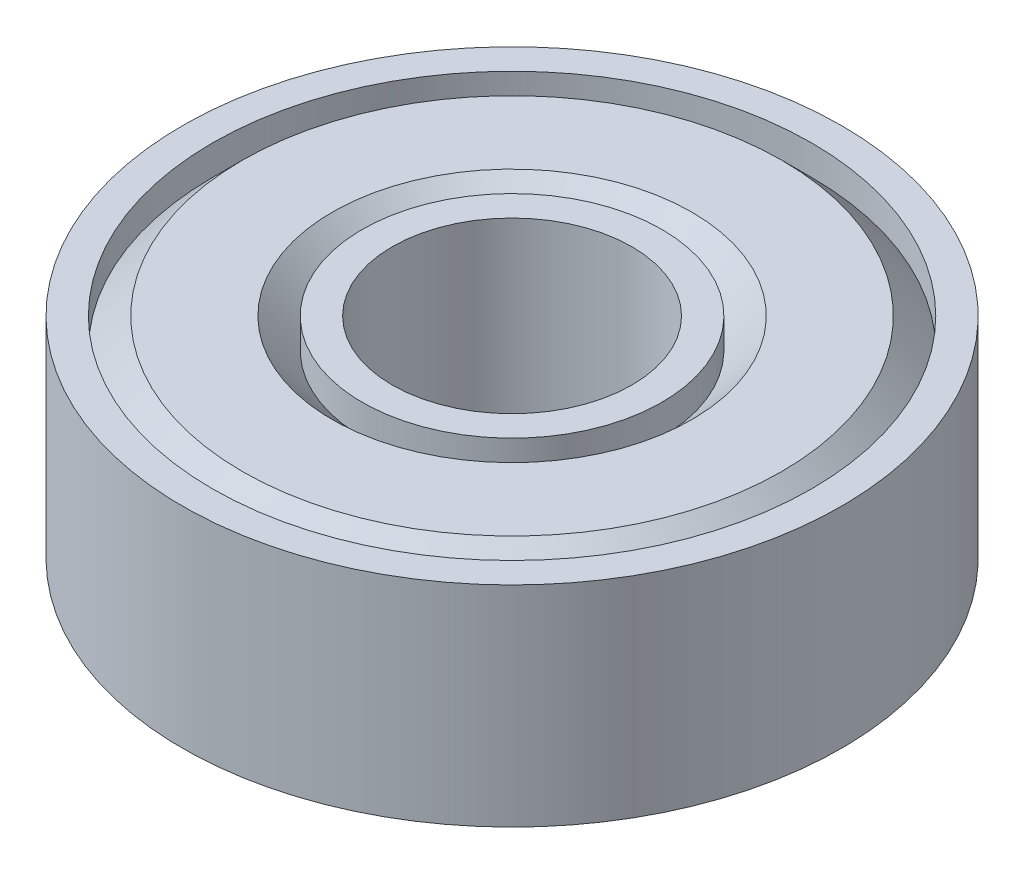
ISO-10303-21;
HEADER;
FILE_DESCRIPTION(('STEP AP214'),'2;1');
FILE_NAME('part.step','',(''),(''),'','','');
FILE_SCHEMA(('AUTOMOTIVE_DESIGN { 1 0 10303 214 1 1 1 1 }'));
ENDSEC;
DATA;
#1=APPLICATION_CONTEXT('core data for automotive mechanical design processes');
#2=APPLICATION_PROTOCOL_DEFINITION('international standard','automotive_design',2000,#1);
#3=PRODUCT_CONTEXT('',#1,'mechanical');
#4=PRODUCT('Part','Part','',(#3));
#5=PRODUCT_RELATED_PRODUCT_CATEGORY('part','',(#4));
#6=PRODUCT_DEFINITION_FORMATION('','',#4);
#7=PRODUCT_DEFINITION_CONTEXT('part definition',#1,'design');
#8=PRODUCT_DEFINITION('design','',#6,#7);
#9=PRODUCT_DEFINITION_SHAPE('','',#8);
#10=(LENGTH_UNIT() NAMED_UNIT(*) SI_UNIT(.MILLI.,.METRE.));
#11=(NAMED_UNIT(*) PLANE_ANGLE_UNIT() SI_UNIT($,.RADIAN.));
#12=(NAMED_UNIT(*) SI_UNIT($,.STERADIAN.) SOLID_ANGLE_UNIT());
#13=UNCERTAINTY_MEASURE_WITH_UNIT(LENGTH_MEASURE(1.E-05),#10,'distance_accuracy_value','');
#14=(GEOMETRIC_REPRESENTATION_CONTEXT(3) GLOBAL_UNCERTAINTY_ASSIGNED_CONTEXT((#13)) GLOBAL_UNIT_ASSIGNED_CONTEXT((#10,
#11,#12)) REPRESENTATION_CONTEXT('',''));
#15=CARTESIAN_POINT('',(0.,0.,0.));
#16=DIRECTION('',(0.,0.,1.));
#17=DIRECTION('',(1.,0.,0.));
#18=AXIS2_PLACEMENT_3D('',#15,#16,#17);
#19=CARTESIAN_POINT('',(-30.,7.,0.));
#20=DIRECTION('',(0.,-1.,0.));
#21=DIRECTION('',(0.,0.,-1.));
#22=AXIS2_PLACEMENT_3D('',#19,#20,#21);
#23=CYLINDRICAL_SURFACE('',#22,10.);
#24=CARTESIAN_POINT('',(-30.,0.,0.));
#25=DIRECTION('',(0.,-1.,0.));
#26=DIRECTION('',(0.,0.,-1.));
#27=AXIS2_PLACEMENT_3D('',#24,#25,#26);
#28=CIRCLE('',#27,10.);
#29=CARTESIAN_POINT('',(-30.,0.,-10.));
#30=VERTEX_POINT('',#29);
#31=EDGE_CURVE('E10',#30,#30,#28,.T.);
#32=ORIENTED_EDGE('',*,*,#31,.T.);
#33=EDGE_LOOP('',(#32));
#34=FACE_BOUND('',#33,.T.);
#35=CARTESIAN_POINT('',(-30.,1.,0.));
#36=DIRECTION('',(0.,-1.,0.));
#37=DIRECTION('',(0.,0.,-1.));
#38=AXIS2_PLACEMENT_3D('',#35,#36,#37);
#39=CIRCLE('',#38,10.);
#40=CARTESIAN_POINT('',(-30.,1.,-10.));
#41=VERTEX_POINT('',#40);
#42=EDGE_CURVE('E83',#41,#41,#39,.T.);
#43=ORIENTED_EDGE('',*,*,#42,.F.);
#44=EDGE_LOOP('',(#43));
#45=FACE_BOUND('',#44,.T.);
#46=ADVANCED_FACE('F31',(#34,#45),#23,.F.);
#47=CARTESIAN_POINT('',(-20.,0.,0.));
#48=DIRECTION('',(0.,-1.,0.));
#49=DIRECTION('',(0.,0.,-1.));
#50=AXIS2_PLACEMENT_3D('',#47,#48,#49);
#51=PLANE('',#50);
#52=CARTESIAN_POINT('',(-30.,0.,0.));
#53=DIRECTION('',(0.,-1.,0.));
#54=DIRECTION('',(0.,0.,-1.));
#55=AXIS2_PLACEMENT_3D('',#52,#53,#54);
#56=CIRCLE('',#55,11.);
#57=CARTESIAN_POINT('',(-30.,0.,-11.));
#58=VERTEX_POINT('',#57);
#59=EDGE_CURVE('E37',#58,#58,#56,.T.);
#60=ORIENTED_EDGE('',*,*,#59,.T.);
#61=EDGE_LOOP('',(#60));
#62=FACE_BOUND('',#61,.T.);
#63=ORIENTED_EDGE('',*,*,#31,.F.);
#64=EDGE_LOOP('',(#63));
#65=FACE_BOUND('',#64,.T.);
#66=ADVANCED_FACE('F91',(#62,#65),#51,.T.);
#67=CARTESIAN_POINT('',(-30.,7.,0.));
#68=DIRECTION('',(0.,-1.,0.));
#69=DIRECTION('',(0.,0.,-1.));
#70=AXIS2_PLACEMENT_3D('',#67,#68,#69);
#71=CYLINDRICAL_SURFACE('',#70,11.);
#72=CARTESIAN_POINT('',(-30.,7.,0.));
#73=DIRECTION('',(0.,-1.,0.));
#74=DIRECTION('',(0.,0.,-1.));
#75=AXIS2_PLACEMENT_3D('',#72,#73,#74);
#76=CIRCLE('',#75,11.);
#77=CARTESIAN_POINT('',(-30.,7.,-11.));
#78=VERTEX_POINT('',#77);
#79=EDGE_CURVE('E41',#78,#78,#76,.T.);
#80=ORIENTED_EDGE('',*,*,#79,.T.);
#81=EDGE_LOOP('',(#80));
#82=FACE_BOUND('',#81,.T.);
#83=ORIENTED_EDGE('',*,*,#59,.F.);
#84=EDGE_LOOP('',(#83));
#85=FACE_BOUND('',#84,.T.);
#86=ADVANCED_FACE('F95',(#82,#85),#71,.T.);
#87=CARTESIAN_POINT('',(-19.,7.,0.));
#88=DIRECTION('',(0.,1.,0.));
#89=DIRECTION('',(0.,0.,1.));
#90=AXIS2_PLACEMENT_3D('',#87,#88,#89);
#91=PLANE('',#90);
#92=CARTESIAN_POINT('',(-30.,7.,0.));
#93=DIRECTION('',(0.,-1.,0.));
#94=DIRECTION('',(0.,0.,-1.));
#95=AXIS2_PLACEMENT_3D('',#92,#93,#94);
#96=CIRCLE('',#95,10.);
#97=CARTESIAN_POINT('',(-30.,7.,-10.));
#98=VERTEX_POINT('',#97);
#99=EDGE_CURVE('E45',#98,#98,#96,.T.);
#100=ORIENTED_EDGE('',*,*,#99,.T.);
#101=EDGE_LOOP('',(#100));
#102=FACE_BOUND('',#101,.T.);
#103=ORIENTED_EDGE('',*,*,#79,.F.);
#104=EDGE_LOOP('',(#103));
#105=FACE_BOUND('',#104,.T.);
#106=ADVANCED_FACE('F99',(#102,#105),#91,.T.);
#107=CARTESIAN_POINT('',(-30.,7.,0.));
#108=DIRECTION('',(0.,-1.,0.));
#109=DIRECTION('',(0.,0.,-1.));
#110=AXIS2_PLACEMENT_3D('',#107,#108,#109);
#111=CYLINDRICAL_SURFACE('',#110,9.99999999999999);
#112=CARTESIAN_POINT('',(-30.,6.,0.));
#113=DIRECTION('',(0.,-1.,0.));
#114=DIRECTION('',(0.,0.,-1.));
#115=AXIS2_PLACEMENT_3D('',#112,#113,#114);
#116=CIRCLE('',#115,9.99999999999999);
#117=CARTESIAN_POINT('',(-30.,6.,-9.99999999999999));
#118=VERTEX_POINT('',#117);
#119=EDGE_CURVE('E50',#118,#118,#116,.T.);
#120=ORIENTED_EDGE('',*,*,#119,.T.);
#121=EDGE_LOOP('',(#120));
#122=FACE_BOUND('',#121,.T.);
#123=ORIENTED_EDGE('',*,*,#99,.F.);
#124=EDGE_LOOP('',(#123));
#125=FACE_BOUND('',#124,.T.);
#126=ADVANCED_FACE('F106',(#122,#125),#111,.F.);
#127=CARTESIAN_POINT('',(-30.,6.,0.));
#128=DIRECTION('',(0.,-1.,0.));
#129=DIRECTION('',(0.,0.,-1.));
#130=AXIS2_PLACEMENT_3D('',#127,#128,#129);
#131=CONICAL_SURFACE('',#130,9.99999999999999,0.785398163397442);
#132=CARTESIAN_POINT('',(-30.,7.,0.));
#133=DIRECTION('',(0.,-1.,0.));
#134=DIRECTION('',(0.,0.,-1.));
#135=AXIS2_PLACEMENT_3D('',#132,#133,#134);
#136=CIRCLE('',#135,9.);
#137=CARTESIAN_POINT('',(-30.,7.,-9.));
#138=VERTEX_POINT('',#137);
#139=EDGE_CURVE('E53',#138,#138,#136,.T.);
#140=ORIENTED_EDGE('',*,*,#139,.T.);
#141=EDGE_LOOP('',(#140));
#142=FACE_BOUND('',#141,.T.);
#143=ORIENTED_EDGE('',*,*,#119,.F.);
#144=EDGE_LOOP('',(#143));
#145=FACE_BOUND('',#144,.T.);
#146=ADVANCED_FACE('F110',(#142,#145),#131,.T.);
#147=CARTESIAN_POINT('',(-21.,7.,0.));
#148=DIRECTION('',(0.,1.,0.));
#149=DIRECTION('',(0.,0.,1.));
#150=AXIS2_PLACEMENT_3D('',#147,#148,#149);
#151=PLANE('',#150);
#152=CARTESIAN_POINT('',(-30.,7.,0.));
#153=DIRECTION('',(0.,-1.,0.));
#154=DIRECTION('',(0.,0.,-1.));
#155=AXIS2_PLACEMENT_3D('',#152,#153,#154);
#156=CIRCLE('',#155,6.);
#157=CARTESIAN_POINT('',(-30.,7.,-6.));
#158=VERTEX_POINT('',#157);
#159=EDGE_CURVE('E56',#158,#158,#156,.T.);
#160=ORIENTED_EDGE('',*,*,#159,.T.);
#161=EDGE_LOOP('',(#160));
#162=FACE_BOUND('',#161,.T.);
#163=ORIENTED_EDGE('',*,*,#139,.F.);
#164=EDGE_LOOP('',(#163));
#165=FACE_BOUND('',#164,.T.);
#166=ADVANCED_FACE('F114',(#162,#165),#151,.T.);
#167=CARTESIAN_POINT('',(-30.,7.,0.));
#168=DIRECTION('',(0.,1.,0.));
#169=DIRECTION('',(0.,0.,1.));
#170=AXIS2_PLACEMENT_3D('',#167,#168,#169);
#171=CONICAL_SURFACE('',#170,6.,0.785398163397449);
#172=CARTESIAN_POINT('',(-30.,6.,0.));
#173=DIRECTION('',(0.,-1.,0.));
#174=DIRECTION('',(0.,0.,-1.));
#175=AXIS2_PLACEMENT_3D('',#172,#173,#174);
#176=CIRCLE('',#175,5.);
#177=CARTESIAN_POINT('',(-30.,6.,-5.));
#178=VERTEX_POINT('',#177);
#179=EDGE_CURVE('E59',#178,#178,#176,.T.);
#180=ORIENTED_EDGE('',*,*,#179,.T.);
#181=EDGE_LOOP('',(#180));
#182=FACE_BOUND('',#181,.T.);
#183=ORIENTED_EDGE('',*,*,#159,.F.);
#184=EDGE_LOOP('',(#183));
#185=FACE_BOUND('',#184,.T.);
#186=ADVANCED_FACE('F118',(#182,#185),#171,.F.);
#187=CARTESIAN_POINT('',(-30.,7.,0.));
#188=DIRECTION('',(0.,-1.,0.));
#189=DIRECTION('',(0.,0.,-1.));
#190=AXIS2_PLACEMENT_3D('',#187,#188,#189);
#191=CYLINDRICAL_SURFACE('',#190,5.);
#192=CARTESIAN_POINT('',(-30.,7.,0.));
#193=DIRECTION('',(0.,-1.,0.));
#194=DIRECTION('',(0.,0.,-1.));
#195=AXIS2_PLACEMENT_3D('',#192,#193,#194);
#196=CIRCLE('',#195,5.);
#197=CARTESIAN_POINT('',(-30.,7.,-5.));
#198=VERTEX_POINT('',#197);
#199=EDGE_CURVE('E62',#198,#198,#196,.T.);
#200=ORIENTED_EDGE('',*,*,#199,.T.);
#201=EDGE_LOOP('',(#200));
#202=FACE_BOUND('',#201,.T.);
#203=ORIENTED_EDGE('',*,*,#179,.F.);
#204=EDGE_LOOP('',(#203));
#205=FACE_BOUND('',#204,.T.);
#206=ADVANCED_FACE('F122',(#202,#205),#191,.T.);
#207=CARTESIAN_POINT('',(-25.,7.,0.));
#208=DIRECTION('',(0.,1.,0.));
#209=DIRECTION('',(0.,0.,1.));
#210=AXIS2_PLACEMENT_3D('',#207,#208,#209);
#211=PLANE('',#210);
#212=CARTESIAN_POINT('',(-30.,7.,0.));
#213=DIRECTION('',(0.,-1.,0.));
#214=DIRECTION('',(0.,0.,-1.));
#215=AXIS2_PLACEMENT_3D('',#212,#213,#214);
#216=CIRCLE('',#215,4.);
#217=CARTESIAN_POINT('',(-30.,7.,-4.));
#218=VERTEX_POINT('',#217);
#219=EDGE_CURVE('E65',#218,#218,#216,.T.);
#220=ORIENTED_EDGE('',*,*,#219,.T.);
#221=EDGE_LOOP('',(#220));
#222=FACE_BOUND('',#221,.T.);
#223=ORIENTED_EDGE('',*,*,#199,.F.);
#224=EDGE_LOOP('',(#223));
#225=FACE_BOUND('',#224,.T.);
#226=ADVANCED_FACE('F126',(#222,#225),#211,.T.);
#227=CARTESIAN_POINT('',(-30.,7.,0.));
#228=DIRECTION('',(0.,-1.,0.));
#229=DIRECTION('',(0.,0.,-1.));
#230=AXIS2_PLACEMENT_3D('',#227,#228,#229);
#231=CYLINDRICAL_SURFACE('',#230,4.);
#232=CARTESIAN_POINT('',(-30.,0.,0.));
#233=DIRECTION('',(0.,-1.,0.));
#234=DIRECTION('',(0.,0.,-1.));
#235=AXIS2_PLACEMENT_3D('',#232,#233,#234);
#236=CIRCLE('',#235,4.);
#237=CARTESIAN_POINT('',(-30.,0.,-4.));
#238=VERTEX_POINT('',#237);
#239=EDGE_CURVE('E68',#238,#238,#236,.T.);
#240=ORIENTED_EDGE('',*,*,#239,.T.);
#241=EDGE_LOOP('',(#240));
#242=FACE_BOUND('',#241,.T.);
#243=ORIENTED_EDGE('',*,*,#219,.F.);
#244=EDGE_LOOP('',(#243));
#245=FACE_BOUND('',#244,.T.);
#246=ADVANCED_FACE('F130',(#242,#245),#231,.F.);
#247=CARTESIAN_POINT('',(-26.,0.,0.));
#248=DIRECTION('',(0.,-1.,0.));
#249=DIRECTION('',(0.,0.,-1.));
#250=AXIS2_PLACEMENT_3D('',#247,#248,#249);
#251=PLANE('',#250);
#252=CARTESIAN_POINT('',(-30.,0.,0.));
#253=DIRECTION('',(0.,-1.,0.));
#254=DIRECTION('',(0.,0.,-1.));
#255=AXIS2_PLACEMENT_3D('',#252,#253,#254);
#256=CIRCLE('',#255,5.);
#257=CARTESIAN_POINT('',(-30.,0.,-5.));
#258=VERTEX_POINT('',#257);
#259=EDGE_CURVE('E71',#258,#258,#256,.T.);
#260=ORIENTED_EDGE('',*,*,#259,.T.);
#261=EDGE_LOOP('',(#260));
#262=FACE_BOUND('',#261,.T.);
#263=ORIENTED_EDGE('',*,*,#239,.F.);
#264=EDGE_LOOP('',(#263));
#265=FACE_BOUND('',#264,.T.);
#266=ADVANCED_FACE('F134',(#262,#265),#251,.T.);
#267=CARTESIAN_POINT('',(-30.,7.,0.));
#268=DIRECTION('',(0.,-1.,0.));
#269=DIRECTION('',(0.,0.,-1.));
#270=AXIS2_PLACEMENT_3D('',#267,#268,#269);
#271=CYLINDRICAL_SURFACE('',#270,5.);
#272=CARTESIAN_POINT('',(-30.,1.,0.));
#273=DIRECTION('',(0.,-1.,0.));
#274=DIRECTION('',(0.,0.,-1.));
#275=AXIS2_PLACEMENT_3D('',#272,#273,#274);
#276=CIRCLE('',#275,5.);
#277=CARTESIAN_POINT('',(-30.,1.,-5.));
#278=VERTEX_POINT('',#277);
#279=EDGE_CURVE('E74',#278,#278,#276,.T.);
#280=ORIENTED_EDGE('',*,*,#279,.T.);
#281=EDGE_LOOP('',(#280));
#282=FACE_BOUND('',#281,.T.);
#283=ORIENTED_EDGE('',*,*,#259,.F.);
#284=EDGE_LOOP('',(#283));
#285=FACE_BOUND('',#284,.T.);
#286=ADVANCED_FACE('F138',(#282,#285),#271,.T.);
#287=CARTESIAN_POINT('',(-30.,1.,0.));
#288=DIRECTION('',(0.,-1.,0.));
#289=DIRECTION('',(0.,0.,-1.));
#290=AXIS2_PLACEMENT_3D('',#287,#288,#289);
#291=CONICAL_SURFACE('',#290,5.,0.78539816339745);
#292=CARTESIAN_POINT('',(-30.,0.,0.));
#293=DIRECTION('',(0.,-1.,0.));
#294=DIRECTION('',(0.,0.,-1.));
#295=AXIS2_PLACEMENT_3D('',#292,#293,#294);
#296=CIRCLE('',#295,6.);
#297=CARTESIAN_POINT('',(-30.,0.,-6.));
#298=VERTEX_POINT('',#297);
#299=EDGE_CURVE('E77',#298,#298,#296,.T.);
#300=ORIENTED_EDGE('',*,*,#299,.T.);
#301=EDGE_LOOP('',(#300));
#302=FACE_BOUND('',#301,.T.);
#303=ORIENTED_EDGE('',*,*,#279,.F.);
#304=EDGE_LOOP('',(#303));
#305=FACE_BOUND('',#304,.T.);
#306=ADVANCED_FACE('F142',(#302,#305),#291,.F.);
#307=CARTESIAN_POINT('',(-24.,0.,0.));
#308=DIRECTION('',(0.,-1.,0.));
#309=DIRECTION('',(0.,0.,-1.));
#310=AXIS2_PLACEMENT_3D('',#307,#308,#309);
#311=PLANE('',#310);
#312=CARTESIAN_POINT('',(-30.,0.,0.));
#313=DIRECTION('',(0.,-1.,0.));
#314=DIRECTION('',(0.,0.,-1.));
#315=AXIS2_PLACEMENT_3D('',#312,#313,#314);
#316=CIRCLE('',#315,9.);
#317=CARTESIAN_POINT('',(-30.,0.,-9.));
#318=VERTEX_POINT('',#317);
#319=EDGE_CURVE('E80',#318,#318,#316,.T.);
#320=ORIENTED_EDGE('',*,*,#319,.T.);
#321=EDGE_LOOP('',(#320));
#322=FACE_BOUND('',#321,.T.);
#323=ORIENTED_EDGE('',*,*,#299,.F.);
#324=EDGE_LOOP('',(#323));
#325=FACE_BOUND('',#324,.T.);
#326=ADVANCED_FACE('F146',(#322,#325),#311,.T.);
#327=CARTESIAN_POINT('',(-30.,0.,0.));
#328=DIRECTION('',(0.,1.,0.));
#329=DIRECTION('',(0.,0.,1.));
#330=AXIS2_PLACEMENT_3D('',#327,#328,#329);
#331=CONICAL_SURFACE('',#330,9.,0.785398163397446);
#332=ORIENTED_EDGE('',*,*,#42,.T.);
#333=EDGE_LOOP('',(#332));
#334=FACE_BOUND('',#333,.T.);
#335=ORIENTED_EDGE('',*,*,#319,.F.);
#336=EDGE_LOOP('',(#335));
#337=FACE_BOUND('',#336,.T.);
#338=ADVANCED_FACE('F87',(#334,#337),#331,.T.);
#339=CLOSED_SHELL('',(#46,#66,#86,#106,#126,#146,#166,#186,#206,#226,#246,#266,#286,#306,#326,#338));
#340=MANIFOLD_SOLID_BREP('B2',#339);
#341=ADVANCED_BREP_SHAPE_REPRESENTATION('',(#18,#340),#14);
#342=SHAPE_DEFINITION_REPRESENTATION(#9,#341);
ENDSEC;
END-ISO-10303-21;
